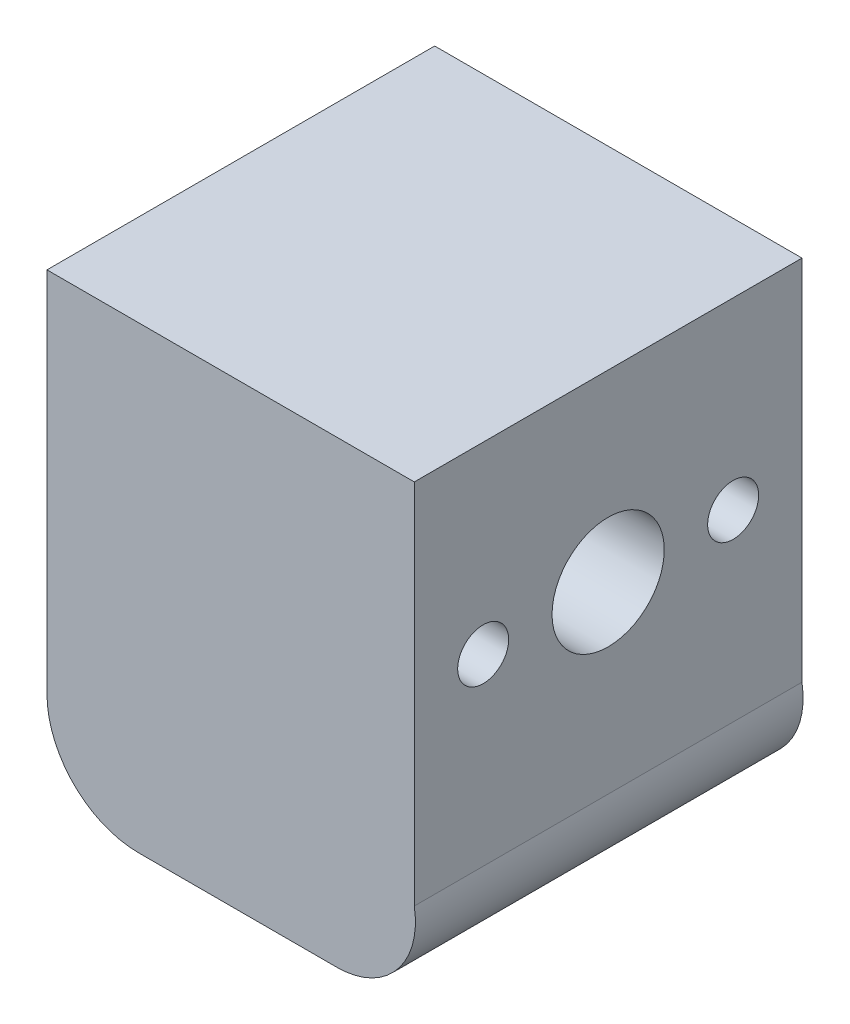
ISO-10303-21;
HEADER;
FILE_DESCRIPTION(('STEP AP214'),'2;1');
FILE_NAME('part.step','',(''),(''),'','','');
FILE_SCHEMA(('AUTOMOTIVE_DESIGN { 1 0 10303 214 1 1 1 1 }'));
ENDSEC;
DATA;
#1=APPLICATION_CONTEXT('core data for automotive mechanical design processes');
#2=APPLICATION_PROTOCOL_DEFINITION('international standard','automotive_design',2000,#1);
#3=PRODUCT_CONTEXT('',#1,'mechanical');
#4=PRODUCT('Part','Part','',(#3));
#5=PRODUCT_RELATED_PRODUCT_CATEGORY('part','',(#4));
#6=PRODUCT_DEFINITION_FORMATION('','',#4);
#7=PRODUCT_DEFINITION_CONTEXT('part definition',#1,'design');
#8=PRODUCT_DEFINITION('design','',#6,#7);
#9=PRODUCT_DEFINITION_SHAPE('','',#8);
#10=(LENGTH_UNIT() NAMED_UNIT(*) SI_UNIT(.MILLI.,.METRE.));
#11=(NAMED_UNIT(*) PLANE_ANGLE_UNIT() SI_UNIT($,.RADIAN.));
#12=(NAMED_UNIT(*) SI_UNIT($,.STERADIAN.) SOLID_ANGLE_UNIT());
#13=UNCERTAINTY_MEASURE_WITH_UNIT(LENGTH_MEASURE(1.E-05),#10,'distance_accuracy_value','');
#14=(GEOMETRIC_REPRESENTATION_CONTEXT(3) GLOBAL_UNCERTAINTY_ASSIGNED_CONTEXT((#13)) GLOBAL_UNIT_ASSIGNED_CONTEXT((#10,
#11,#12)) REPRESENTATION_CONTEXT('',''));
#15=CARTESIAN_POINT('',(0.,0.,0.));
#16=DIRECTION('',(0.,0.,1.));
#17=DIRECTION('',(1.,0.,0.));
#18=AXIS2_PLACEMENT_3D('',#15,#16,#17);
#19=CARTESIAN_POINT('',(-19.2040624835271,20.6616211884216,9.5));
#20=DIRECTION('',(0.,-1.,0.));
#21=DIRECTION('',(0.,0.,-1.));
#22=AXIS2_PLACEMENT_3D('',#19,#20,#21);
#23=PLANE('',#22);
#24=DIRECTION('',(-1.,0.,0.));
#25=VECTOR('',#24,1.);
#26=CARTESIAN_POINT('',(-19.2040624835271,20.6616211884216,-9.5));
#27=LINE('',#26,#25);
#28=CARTESIAN_POINT('',(-19.2040624835271,20.6616211884216,-9.5));
#29=VERTEX_POINT('',#28);
#30=CARTESIAN_POINT('',(-37.2040624835271,20.6616211884216,-9.5));
#31=VERTEX_POINT('',#30);
#32=EDGE_CURVE('E130',#29,#31,#27,.T.);
#33=ORIENTED_EDGE('',*,*,#32,.T.);
#34=DIRECTION('',(0.,0.,-1.));
#35=VECTOR('',#34,1.);
#36=CARTESIAN_POINT('',(-37.2040624835271,20.6616211884216,9.5));
#37=LINE('',#36,#35);
#38=CARTESIAN_POINT('',(-37.2040624835271,20.6616211884216,9.5));
#39=VERTEX_POINT('',#38);
#40=EDGE_CURVE('E11',#39,#31,#37,.T.);
#41=ORIENTED_EDGE('',*,*,#40,.F.);
#42=DIRECTION('',(-1.,0.,0.));
#43=VECTOR('',#42,1.);
#44=CARTESIAN_POINT('',(-19.2040624835271,20.6616211884216,9.5));
#45=LINE('',#44,#43);
#46=CARTESIAN_POINT('',(-19.2040624835271,20.6616211884216,9.5));
#47=VERTEX_POINT('',#46);
#48=EDGE_CURVE('E146',#47,#39,#45,.T.);
#49=ORIENTED_EDGE('',*,*,#48,.F.);
#50=DIRECTION('',(0.,0.,-1.));
#51=VECTOR('',#50,1.);
#52=CARTESIAN_POINT('',(-19.2040624835271,20.6616211884216,9.5));
#53=LINE('',#52,#51);
#54=EDGE_CURVE('E126',#47,#29,#53,.T.);
#55=ORIENTED_EDGE('',*,*,#54,.T.);
#56=EDGE_LOOP('',(#33,#41,#49,#55));
#57=FACE_BOUND('',#56,.T.);
#58=ADVANCED_FACE('F39',(#57),#23,.F.);
#59=CARTESIAN_POINT('',(-37.2040624835271,20.6616211884216,9.5));
#60=DIRECTION('',(1.,0.,0.));
#61=DIRECTION('',(0.,1.,0.));
#62=AXIS2_PLACEMENT_3D('',#59,#60,#61);
#63=PLANE('',#62);
#64=CARTESIAN_POINT('',(-37.2040624835271,11.6616211884216,-6.125));
#65=DIRECTION('',(-1.,0.,0.));
#66=DIRECTION('',(0.,0.,1.));
#67=AXIS2_PLACEMENT_3D('',#64,#65,#66);
#68=CIRCLE('',#67,1.25);
#69=CARTESIAN_POINT('',(-37.2040624835271,11.6616211884216,-4.875));
#70=VERTEX_POINT('',#69);
#71=EDGE_CURVE('E209',#70,#70,#68,.T.);
#72=ORIENTED_EDGE('',*,*,#71,.F.);
#73=EDGE_LOOP('',(#72));
#74=FACE_BOUND('',#73,.T.);
#75=CARTESIAN_POINT('',(-37.2040624835271,11.6616211884216,6.125));
#76=DIRECTION('',(-1.,0.,0.));
#77=DIRECTION('',(0.,0.,1.));
#78=AXIS2_PLACEMENT_3D('',#75,#76,#77);
#79=CIRCLE('',#78,1.25);
#80=CARTESIAN_POINT('',(-37.2040624835271,11.6616211884216,7.375));
#81=VERTEX_POINT('',#80);
#82=EDGE_CURVE('E208',#81,#81,#79,.T.);
#83=ORIENTED_EDGE('',*,*,#82,.F.);
#84=EDGE_LOOP('',(#83));
#85=FACE_BOUND('',#84,.T.);
#86=CARTESIAN_POINT('',(-37.2040624835271,11.6616211884216,0.));
#87=DIRECTION('',(-1.,0.,0.));
#88=DIRECTION('',(0.,0.,1.));
#89=AXIS2_PLACEMENT_3D('',#86,#87,#88);
#90=CIRCLE('',#89,2.75);
#91=CARTESIAN_POINT('',(-37.2040624835271,11.6616211884216,2.75));
#92=VERTEX_POINT('',#91);
#93=EDGE_CURVE('E160',#92,#92,#90,.T.);
#94=ORIENTED_EDGE('',*,*,#93,.F.);
#95=EDGE_LOOP('',(#94));
#96=FACE_BOUND('',#95,.T.);
#97=DIRECTION('',(0.,-1.,0.));
#98=VECTOR('',#97,1.);
#99=CARTESIAN_POINT('',(-37.2040624835271,20.6616211884216,-9.5));
#100=LINE('',#99,#98);
#101=CARTESIAN_POINT('',(-37.2040624835271,2.66162118842164,-9.5));
#102=VERTEX_POINT('',#101);
#103=EDGE_CURVE('E134',#31,#102,#100,.T.);
#104=ORIENTED_EDGE('',*,*,#103,.T.);
#105=DIRECTION('',(0.,0.,-1.));
#106=VECTOR('',#105,1.);
#107=CARTESIAN_POINT('',(-37.2040624835271,2.66162118842164,9.5));
#108=LINE('',#107,#106);
#109=CARTESIAN_POINT('',(-37.2040624835271,2.66162118842164,9.5));
#110=VERTEX_POINT('',#109);
#111=EDGE_CURVE('E49',#110,#102,#108,.T.);
#112=ORIENTED_EDGE('',*,*,#111,.F.);
#113=DIRECTION('',(0.,-1.,0.));
#114=VECTOR('',#113,1.);
#115=CARTESIAN_POINT('',(-37.2040624835271,20.6616211884216,9.5));
#116=LINE('',#115,#114);
#117=EDGE_CURVE('E95',#39,#110,#116,.T.);
#118=ORIENTED_EDGE('',*,*,#117,.F.);
#119=ORIENTED_EDGE('',*,*,#40,.T.);
#120=EDGE_LOOP('',(#104,#112,#118,#119));
#121=FACE_BOUND('',#120,.T.);
#122=ADVANCED_FACE('F185',(#74,#85,#96,#121),#63,.F.);
#123=CARTESIAN_POINT('',(-32.7072893349103,2.66162118842164,9.5));
#124=DIRECTION('',(0.,0.,-1.));
#125=DIRECTION('',(-1.,0.,0.));
#126=AXIS2_PLACEMENT_3D('',#123,#124,#125);
#127=CYLINDRICAL_SURFACE('',#126,4.49677314861677);
#128=CARTESIAN_POINT('',(-32.7072893349103,2.66162118842164,-9.5));
#129=DIRECTION('',(0.,0.,1.));
#130=DIRECTION('',(1.,0.,0.));
#131=AXIS2_PLACEMENT_3D('',#128,#129,#130);
#132=CIRCLE('',#131,4.49677314861677);
#133=CARTESIAN_POINT('',(-32.7072893349103,-1.83515196019513,-9.5));
#134=VERTEX_POINT('',#133);
#135=EDGE_CURVE('E137',#102,#134,#132,.T.);
#136=ORIENTED_EDGE('',*,*,#135,.T.);
#137=DIRECTION('',(0.,0.,-1.));
#138=VECTOR('',#137,1.);
#139=CARTESIAN_POINT('',(-32.7072893349103,-1.83515196019513,9.5));
#140=LINE('',#139,#138);
#141=CARTESIAN_POINT('',(-32.7072893349103,-1.83515196019513,9.5));
#142=VERTEX_POINT('',#141);
#143=EDGE_CURVE('E119',#142,#134,#140,.T.);
#144=ORIENTED_EDGE('',*,*,#143,.F.);
#145=CARTESIAN_POINT('',(-32.7072893349103,2.66162118842164,9.5));
#146=DIRECTION('',(0.,0.,1.));
#147=DIRECTION('',(1.,0.,0.));
#148=AXIS2_PLACEMENT_3D('',#145,#146,#147);
#149=CIRCLE('',#148,4.49677314861677);
#150=EDGE_CURVE('E108',#110,#142,#149,.T.);
#151=ORIENTED_EDGE('',*,*,#150,.F.);
#152=ORIENTED_EDGE('',*,*,#111,.T.);
#153=EDGE_LOOP('',(#136,#144,#151,#152));
#154=FACE_BOUND('',#153,.T.);
#155=ADVANCED_FACE('F190',(#154),#127,.T.);
#156=CARTESIAN_POINT('',(-32.7072893349103,-1.83515196019513,9.5));
#157=DIRECTION('',(0.,1.,0.));
#158=DIRECTION('',(0.,0.,1.));
#159=AXIS2_PLACEMENT_3D('',#156,#157,#158);
#160=PLANE('',#159);
#161=DIRECTION('',(1.,0.,0.));
#162=VECTOR('',#161,1.);
#163=CARTESIAN_POINT('',(-32.7072893349103,-1.83515196019513,-9.5));
#164=LINE('',#163,#162);
#165=CARTESIAN_POINT('',(-22.9996921714055,-1.83515196019513,-9.5));
#166=VERTEX_POINT('',#165);
#167=EDGE_CURVE('E117',#134,#166,#164,.T.);
#168=ORIENTED_EDGE('',*,*,#167,.T.);
#169=DIRECTION('',(0.,0.,-1.));
#170=VECTOR('',#169,1.);
#171=CARTESIAN_POINT('',(-22.9996921714055,-1.83515196019513,9.5));
#172=LINE('',#171,#170);
#173=CARTESIAN_POINT('',(-22.9996921714055,-1.83515196019513,9.5));
#174=VERTEX_POINT('',#173);
#175=EDGE_CURVE('E114',#174,#166,#172,.T.);
#176=ORIENTED_EDGE('',*,*,#175,.F.);
#177=DIRECTION('',(1.,0.,0.));
#178=VECTOR('',#177,1.);
#179=CARTESIAN_POINT('',(-32.7072893349103,-1.83515196019513,9.5));
#180=LINE('',#179,#178);
#181=EDGE_CURVE('E102',#142,#174,#180,.T.);
#182=ORIENTED_EDGE('',*,*,#181,.F.);
#183=ORIENTED_EDGE('',*,*,#143,.T.);
#184=EDGE_LOOP('',(#168,#176,#182,#183));
#185=FACE_BOUND('',#184,.T.);
#186=ADVANCED_FACE('F115',(#185),#160,.F.);
#187=CARTESIAN_POINT('',(-22.9996921714055,2.01513938575329,9.5));
#188=DIRECTION('',(0.,0.,-1.));
#189=DIRECTION('',(-1.,0.,0.));
#190=AXIS2_PLACEMENT_3D('',#187,#188,#189);
#191=CYLINDRICAL_SURFACE('',#190,3.85029134594843);
#192=CARTESIAN_POINT('',(-22.9996921714055,2.01513938575329,-9.5));
#193=DIRECTION('',(0.,0.,1.));
#194=DIRECTION('',(1.,0.,0.));
#195=AXIS2_PLACEMENT_3D('',#192,#193,#194);
#196=CIRCLE('',#195,3.85029134594843);
#197=CARTESIAN_POINT('',(-19.2040624835271,2.66162118842164,-9.5));
#198=VERTEX_POINT('',#197);
#199=EDGE_CURVE('E81',#166,#198,#196,.T.);
#200=ORIENTED_EDGE('',*,*,#199,.T.);
#201=DIRECTION('',(0.,0.,-1.));
#202=VECTOR('',#201,1.);
#203=CARTESIAN_POINT('',(-19.2040624835271,2.66162118842164,9.5));
#204=LINE('',#203,#202);
#205=CARTESIAN_POINT('',(-19.2040624835271,2.66162118842164,9.5));
#206=VERTEX_POINT('',#205);
#207=EDGE_CURVE('E120',#206,#198,#204,.T.);
#208=ORIENTED_EDGE('',*,*,#207,.F.);
#209=CARTESIAN_POINT('',(-22.9996921714055,2.01513938575329,9.5));
#210=DIRECTION('',(0.,0.,1.));
#211=DIRECTION('',(1.,0.,0.));
#212=AXIS2_PLACEMENT_3D('',#209,#210,#211);
#213=CIRCLE('',#212,3.85029134594843);
#214=EDGE_CURVE('E106',#174,#206,#213,.T.);
#215=ORIENTED_EDGE('',*,*,#214,.F.);
#216=ORIENTED_EDGE('',*,*,#175,.T.);
#217=EDGE_LOOP('',(#200,#208,#215,#216));
#218=FACE_BOUND('',#217,.T.);
#219=ADVANCED_FACE('F122',(#218),#191,.T.);
#220=CARTESIAN_POINT('',(-19.2040624835271,2.66162118842164,9.5));
#221=DIRECTION('',(-1.,0.,0.));
#222=DIRECTION('',(0.,-1.,0.));
#223=AXIS2_PLACEMENT_3D('',#220,#221,#222);
#224=PLANE('',#223);
#225=CARTESIAN_POINT('',(-19.2040624835271,11.6616211884216,-6.125));
#226=DIRECTION('',(-1.,0.,0.));
#227=DIRECTION('',(0.,-1.,0.));
#228=AXIS2_PLACEMENT_3D('',#225,#226,#227);
#229=CIRCLE('',#228,1.25);
#230=CARTESIAN_POINT('',(-19.2040624835271,10.4116211884216,-6.125));
#231=VERTEX_POINT('',#230);
#232=EDGE_CURVE('E42',#231,#231,#229,.T.);
#233=ORIENTED_EDGE('',*,*,#232,.T.);
#234=EDGE_LOOP('',(#233));
#235=FACE_BOUND('',#234,.T.);
#236=CARTESIAN_POINT('',(-19.2040624835271,11.6616211884216,6.125));
#237=DIRECTION('',(-1.,0.,0.));
#238=DIRECTION('',(0.,-1.,0.));
#239=AXIS2_PLACEMENT_3D('',#236,#237,#238);
#240=CIRCLE('',#239,1.25);
#241=CARTESIAN_POINT('',(-19.2040624835271,10.4116211884216,6.125));
#242=VERTEX_POINT('',#241);
#243=EDGE_CURVE('E159',#242,#242,#240,.T.);
#244=ORIENTED_EDGE('',*,*,#243,.T.);
#245=EDGE_LOOP('',(#244));
#246=FACE_BOUND('',#245,.T.);
#247=CARTESIAN_POINT('',(-19.2040624835271,11.6616211884216,0.));
#248=DIRECTION('',(-1.,0.,0.));
#249=DIRECTION('',(0.,-1.,0.));
#250=AXIS2_PLACEMENT_3D('',#247,#248,#249);
#251=CIRCLE('',#250,2.75);
#252=CARTESIAN_POINT('',(-19.2040624835271,8.91162118842164,0.));
#253=VERTEX_POINT('',#252);
#254=EDGE_CURVE('E156',#253,#253,#251,.T.);
#255=ORIENTED_EDGE('',*,*,#254,.T.);
#256=EDGE_LOOP('',(#255));
#257=FACE_BOUND('',#256,.T.);
#258=DIRECTION('',(0.,1.,0.));
#259=VECTOR('',#258,1.);
#260=CARTESIAN_POINT('',(-19.2040624835271,2.66162118842164,-9.5));
#261=LINE('',#260,#259);
#262=EDGE_CURVE('E87',#198,#29,#261,.T.);
#263=ORIENTED_EDGE('',*,*,#262,.T.);
#264=ORIENTED_EDGE('',*,*,#54,.F.);
#265=DIRECTION('',(0.,1.,0.));
#266=VECTOR('',#265,1.);
#267=CARTESIAN_POINT('',(-19.2040624835271,2.66162118842164,9.5));
#268=LINE('',#267,#266);
#269=EDGE_CURVE('E58',#206,#47,#268,.T.);
#270=ORIENTED_EDGE('',*,*,#269,.F.);
#271=ORIENTED_EDGE('',*,*,#207,.T.);
#272=EDGE_LOOP('',(#263,#264,#270,#271));
#273=FACE_BOUND('',#272,.T.);
#274=ADVANCED_FACE('F169',(#235,#246,#257,#273),#224,.F.);
#275=CARTESIAN_POINT('',(-32.7072893349103,2.66162118842164,9.5));
#276=DIRECTION('',(0.,0.,1.));
#277=DIRECTION('',(1.,0.,0.));
#278=AXIS2_PLACEMENT_3D('',#275,#276,#277);
#279=PLANE('',#278);
#280=ORIENTED_EDGE('',*,*,#48,.T.);
#281=ORIENTED_EDGE('',*,*,#117,.T.);
#282=ORIENTED_EDGE('',*,*,#150,.T.);
#283=ORIENTED_EDGE('',*,*,#181,.T.);
#284=ORIENTED_EDGE('',*,*,#214,.T.);
#285=ORIENTED_EDGE('',*,*,#269,.T.);
#286=EDGE_LOOP('',(#280,#281,#282,#283,#284,#285));
#287=FACE_BOUND('',#286,.T.);
#288=ADVANCED_FACE('F104',(#287),#279,.T.);
#289=CARTESIAN_POINT('',(-32.7072893349103,2.66162118842164,-9.5));
#290=DIRECTION('',(0.,0.,1.));
#291=DIRECTION('',(1.,0.,0.));
#292=AXIS2_PLACEMENT_3D('',#289,#290,#291);
#293=PLANE('',#292);
#294=ORIENTED_EDGE('',*,*,#32,.F.);
#295=ORIENTED_EDGE('',*,*,#262,.F.);
#296=ORIENTED_EDGE('',*,*,#199,.F.);
#297=ORIENTED_EDGE('',*,*,#167,.F.);
#298=ORIENTED_EDGE('',*,*,#135,.F.);
#299=ORIENTED_EDGE('',*,*,#103,.F.);
#300=EDGE_LOOP('',(#294,#295,#296,#297,#298,#299));
#301=FACE_BOUND('',#300,.T.);
#302=ADVANCED_FACE('F196',(#301),#293,.F.);
#303=CARTESIAN_POINT('',(-19.1494008254571,11.6616211884216,0.));
#304=DIRECTION('',(-1.,0.,0.));
#305=DIRECTION('',(0.,0.,1.));
#306=AXIS2_PLACEMENT_3D('',#303,#304,#305);
#307=CYLINDRICAL_SURFACE('',#306,2.75);
#308=ORIENTED_EDGE('',*,*,#93,.T.);
#309=EDGE_LOOP('',(#308));
#310=FACE_BOUND('',#309,.T.);
#311=ORIENTED_EDGE('',*,*,#254,.F.);
#312=EDGE_LOOP('',(#311));
#313=FACE_BOUND('',#312,.T.);
#314=ADVANCED_FACE('F179',(#310,#313),#307,.F.);
#315=CARTESIAN_POINT('',(-19.1494008254571,11.6616211884216,6.125));
#316=DIRECTION('',(-1.,0.,0.));
#317=DIRECTION('',(0.,0.,1.));
#318=AXIS2_PLACEMENT_3D('',#315,#316,#317);
#319=CYLINDRICAL_SURFACE('',#318,1.25);
#320=ORIENTED_EDGE('',*,*,#82,.T.);
#321=EDGE_LOOP('',(#320));
#322=FACE_BOUND('',#321,.T.);
#323=ORIENTED_EDGE('',*,*,#243,.F.);
#324=EDGE_LOOP('',(#323));
#325=FACE_BOUND('',#324,.T.);
#326=ADVANCED_FACE('F173',(#322,#325),#319,.F.);
#327=CARTESIAN_POINT('',(-19.1494008254571,11.6616211884216,-6.125));
#328=DIRECTION('',(-1.,0.,0.));
#329=DIRECTION('',(0.,0.,1.));
#330=AXIS2_PLACEMENT_3D('',#327,#328,#329);
#331=CYLINDRICAL_SURFACE('',#330,1.25);
#332=ORIENTED_EDGE('',*,*,#71,.T.);
#333=EDGE_LOOP('',(#332));
#334=FACE_BOUND('',#333,.T.);
#335=ORIENTED_EDGE('',*,*,#232,.F.);
#336=EDGE_LOOP('',(#335));
#337=FACE_BOUND('',#336,.T.);
#338=ADVANCED_FACE('F171',(#334,#337),#331,.F.);
#339=CLOSED_SHELL('',(#58,#122,#155,#186,#219,#274,#288,#302,#314,#326,#338));
#340=MANIFOLD_SOLID_BREP('B2',#339);
#341=ADVANCED_BREP_SHAPE_REPRESENTATION('',(#18,#340),#14);
#342=SHAPE_DEFINITION_REPRESENTATION(#9,#341);
ENDSEC;
END-ISO-10303-21;
